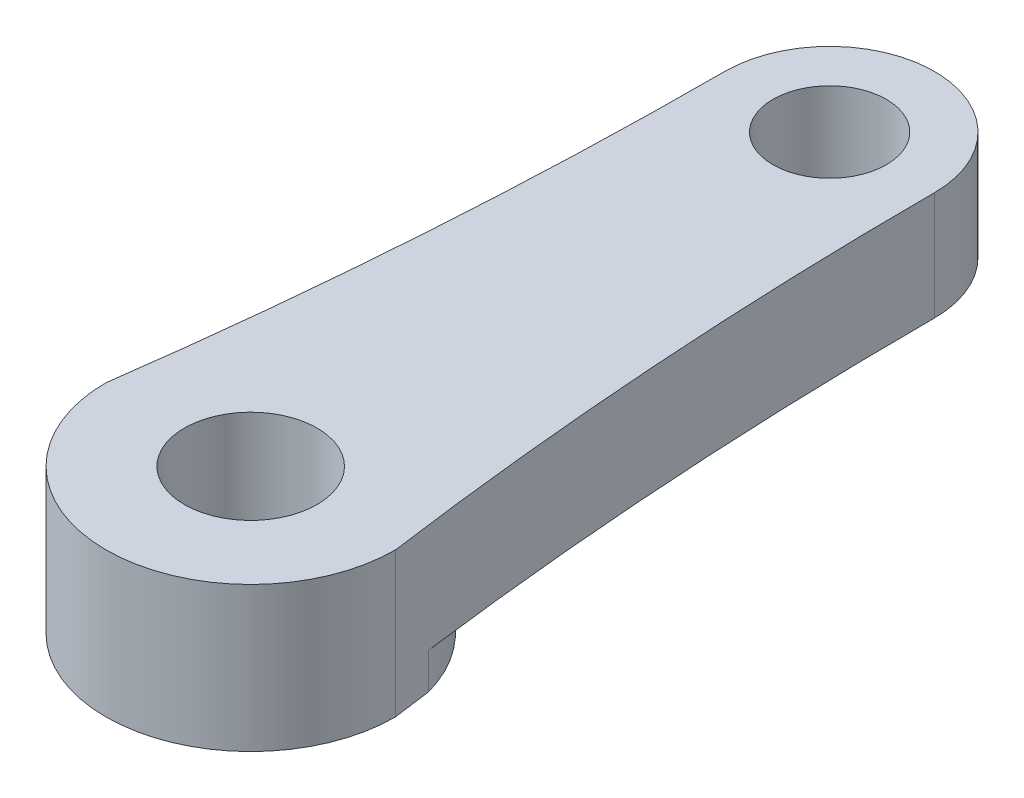
ISO-10303-21;
HEADER;
FILE_DESCRIPTION(('STEP AP214'),'2;1');
FILE_NAME('part.step','',(''),(''),'','','');
FILE_SCHEMA(('AUTOMOTIVE_DESIGN { 1 0 10303 214 1 1 1 1 }'));
ENDSEC;
DATA;
#1=APPLICATION_CONTEXT('core data for automotive mechanical design processes');
#2=APPLICATION_PROTOCOL_DEFINITION('international standard','automotive_design',2000,#1);
#3=PRODUCT_CONTEXT('',#1,'mechanical');
#4=PRODUCT('Part','Part','',(#3));
#5=PRODUCT_RELATED_PRODUCT_CATEGORY('part','',(#4));
#6=PRODUCT_DEFINITION_FORMATION('','',#4);
#7=PRODUCT_DEFINITION_CONTEXT('part definition',#1,'design');
#8=PRODUCT_DEFINITION('design','',#6,#7);
#9=PRODUCT_DEFINITION_SHAPE('','',#8);
#10=(LENGTH_UNIT() NAMED_UNIT(*) SI_UNIT(.MILLI.,.METRE.));
#11=(NAMED_UNIT(*) PLANE_ANGLE_UNIT() SI_UNIT($,.RADIAN.));
#12=(NAMED_UNIT(*) SI_UNIT($,.STERADIAN.) SOLID_ANGLE_UNIT());
#13=UNCERTAINTY_MEASURE_WITH_UNIT(LENGTH_MEASURE(1.E-05),#10,'distance_accuracy_value','');
#14=(GEOMETRIC_REPRESENTATION_CONTEXT(3) GLOBAL_UNCERTAINTY_ASSIGNED_CONTEXT((#13)) GLOBAL_UNIT_ASSIGNED_CONTEXT((#10,
#11,#12)) REPRESENTATION_CONTEXT('',''));
#15=CARTESIAN_POINT('',(0.,0.,0.));
#16=DIRECTION('',(0.,0.,1.));
#17=DIRECTION('',(1.,0.,0.));
#18=AXIS2_PLACEMENT_3D('',#15,#16,#17);
#19=CARTESIAN_POINT('',(179.720454545455,6.,-24.0000000000001));
#20=DIRECTION('',(0.,-1.,0.));
#21=DIRECTION('',(0.,0.,-1.));
#22=AXIS2_PLACEMENT_3D('',#19,#20,#21);
#23=CYLINDRICAL_SURFACE('',#22,175.370454545455);
#24=CARTESIAN_POINT('',(179.720454545455,0.,-24.0000000000001));
#25=DIRECTION('',(0.,1.,0.));
#26=DIRECTION('',(0.,0.,1.));
#27=AXIS2_PLACEMENT_3D('',#24,#25,#26);
#28=CIRCLE('',#27,175.370454545455);
#29=CARTESIAN_POINT('',(5.78975187479319,0.,-1.57441202622919));
#30=VERTEX_POINT('',#29);
#31=CARTESIAN_POINT('',(6.,0.,1.76833374332386E-13));
#32=VERTEX_POINT('',#31);
#33=EDGE_CURVE('E86',#30,#32,#28,.T.);
#34=ORIENTED_EDGE('',*,*,#33,.F.);
#35=DIRECTION('',(0.,-1.,0.));
#36=VECTOR('',#35,1.);
#37=CARTESIAN_POINT('',(5.78975187479319,1.5,-1.57441202622919));
#38=LINE('',#37,#36);
#39=CARTESIAN_POINT('',(5.78975187479319,1.5,-1.57441202622919));
#40=VERTEX_POINT('',#39);
#41=EDGE_CURVE('E62',#40,#30,#38,.T.);
#42=ORIENTED_EDGE('',*,*,#41,.F.);
#43=CARTESIAN_POINT('',(179.720454545455,1.5,-24.0000000000001));
#44=DIRECTION('',(0.,-1.,0.));
#45=DIRECTION('',(0.,0.,-1.));
#46=AXIS2_PLACEMENT_3D('',#43,#44,#45);
#47=CIRCLE('',#46,175.370454545455);
#48=CARTESIAN_POINT('',(4.35,1.5,-24.));
#49=VERTEX_POINT('',#48);
#50=EDGE_CURVE('E125',#49,#40,#47,.F.);
#51=ORIENTED_EDGE('',*,*,#50,.F.);
#52=DIRECTION('',(0.,-1.,0.));
#53=VECTOR('',#52,1.);
#54=CARTESIAN_POINT('',(4.35,6.,-24.));
#55=LINE('',#54,#53);
#56=CARTESIAN_POINT('',(4.35,6.,-24.));
#57=VERTEX_POINT('',#56);
#58=EDGE_CURVE('E11',#57,#49,#55,.T.);
#59=ORIENTED_EDGE('',*,*,#58,.F.);
#60=CARTESIAN_POINT('',(179.720454545455,6.,-24.0000000000001));
#61=DIRECTION('',(0.,1.,0.));
#62=DIRECTION('',(0.,0.,1.));
#63=AXIS2_PLACEMENT_3D('',#60,#61,#62);
#64=CIRCLE('',#63,175.370454545455);
#65=CARTESIAN_POINT('',(6.,6.,1.76833374332386E-13));
#66=VERTEX_POINT('',#65);
#67=EDGE_CURVE('E147',#57,#66,#64,.T.);
#68=ORIENTED_EDGE('',*,*,#67,.T.);
#69=DIRECTION('',(0.,-1.,0.));
#70=VECTOR('',#69,1.);
#71=CARTESIAN_POINT('',(6.,6.,1.76833374332386E-13));
#72=LINE('',#71,#70);
#73=EDGE_CURVE('E167',#66,#32,#72,.T.);
#74=ORIENTED_EDGE('',*,*,#73,.T.);
#75=EDGE_LOOP('',(#34,#42,#51,#59,#68,#74));
#76=FACE_BOUND('',#75,.T.);
#77=ADVANCED_FACE('F47',(#76),#23,.F.);
#78=CARTESIAN_POINT('',(0.,6.,-24.));
#79=DIRECTION('',(0.,-1.,0.));
#80=DIRECTION('',(0.,0.,-1.));
#81=AXIS2_PLACEMENT_3D('',#78,#79,#80);
#82=CYLINDRICAL_SURFACE('',#81,4.35);
#83=CARTESIAN_POINT('',(0.,1.5,-24.));
#84=DIRECTION('',(0.,-1.,0.));
#85=DIRECTION('',(0.,0.,-1.));
#86=AXIS2_PLACEMENT_3D('',#83,#84,#85);
#87=CIRCLE('',#86,4.35);
#88=CARTESIAN_POINT('',(-4.35,1.5,-24.));
#89=VERTEX_POINT('',#88);
#90=EDGE_CURVE('E133',#89,#49,#87,.T.);
#91=ORIENTED_EDGE('',*,*,#90,.F.);
#92=DIRECTION('',(0.,-1.,0.));
#93=VECTOR('',#92,1.);
#94=CARTESIAN_POINT('',(-4.35,6.,-24.));
#95=LINE('',#94,#93);
#96=CARTESIAN_POINT('',(-4.35,6.,-24.));
#97=VERTEX_POINT('',#96);
#98=EDGE_CURVE('E55',#97,#89,#95,.T.);
#99=ORIENTED_EDGE('',*,*,#98,.F.);
#100=CARTESIAN_POINT('',(0.,6.,-24.));
#101=DIRECTION('',(0.,1.,0.));
#102=DIRECTION('',(0.,0.,1.));
#103=AXIS2_PLACEMENT_3D('',#100,#101,#102);
#104=CIRCLE('',#103,4.35);
#105=EDGE_CURVE('E150',#57,#97,#104,.T.);
#106=ORIENTED_EDGE('',*,*,#105,.F.);
#107=ORIENTED_EDGE('',*,*,#58,.T.);
#108=EDGE_LOOP('',(#91,#99,#106,#107));
#109=FACE_BOUND('',#108,.T.);
#110=ADVANCED_FACE('F193',(#109),#82,.T.);
#111=CARTESIAN_POINT('',(-179.720454545455,6.,-24.0000000000001));
#112=DIRECTION('',(0.,-1.,0.));
#113=DIRECTION('',(0.,0.,-1.));
#114=AXIS2_PLACEMENT_3D('',#111,#112,#113);
#115=CYLINDRICAL_SURFACE('',#114,175.370454545455);
#116=DIRECTION('',(0.,-1.,0.));
#117=VECTOR('',#116,1.);
#118=CARTESIAN_POINT('',(-5.78975187479319,1.5,-1.57441202622919));
#119=LINE('',#118,#117);
#120=CARTESIAN_POINT('',(-5.78975187479319,1.5,-1.57441202622919));
#121=VERTEX_POINT('',#120);
#122=CARTESIAN_POINT('',(-5.78975187479319,0.,-1.57441202622919));
#123=VERTEX_POINT('',#122);
#124=EDGE_CURVE('E108',#121,#123,#119,.T.);
#125=ORIENTED_EDGE('',*,*,#124,.T.);
#126=CARTESIAN_POINT('',(-179.720454545455,0.,-24.0000000000001));
#127=DIRECTION('',(0.,1.,0.));
#128=DIRECTION('',(0.,0.,1.));
#129=AXIS2_PLACEMENT_3D('',#126,#127,#128);
#130=CIRCLE('',#129,175.370454545455);
#131=CARTESIAN_POINT('',(-6.,0.,1.76833374332386E-13));
#132=VERTEX_POINT('',#131);
#133=EDGE_CURVE('E170',#123,#132,#130,.F.);
#134=ORIENTED_EDGE('',*,*,#133,.T.);
#135=DIRECTION('',(0.,-1.,0.));
#136=VECTOR('',#135,1.);
#137=CARTESIAN_POINT('',(-6.,6.,1.76833374332386E-13));
#138=LINE('',#137,#136);
#139=CARTESIAN_POINT('',(-6.,6.,1.76833374332386E-13));
#140=VERTEX_POINT('',#139);
#141=EDGE_CURVE('E182',#140,#132,#138,.T.);
#142=ORIENTED_EDGE('',*,*,#141,.F.);
#143=CARTESIAN_POINT('',(-179.720454545455,6.,-24.0000000000001));
#144=DIRECTION('',(0.,1.,0.));
#145=DIRECTION('',(0.,0.,1.));
#146=AXIS2_PLACEMENT_3D('',#143,#144,#145);
#147=CIRCLE('',#146,175.370454545455);
#148=EDGE_CURVE('E154',#97,#140,#147,.F.);
#149=ORIENTED_EDGE('',*,*,#148,.F.);
#150=ORIENTED_EDGE('',*,*,#98,.T.);
#151=CARTESIAN_POINT('',(-179.720454545455,1.5,-24.0000000000001));
#152=DIRECTION('',(0.,-1.,0.));
#153=DIRECTION('',(0.,0.,-1.));
#154=AXIS2_PLACEMENT_3D('',#151,#152,#153);
#155=CIRCLE('',#154,175.370454545455);
#156=EDGE_CURVE('E123',#121,#89,#155,.F.);
#157=ORIENTED_EDGE('',*,*,#156,.F.);
#158=EDGE_LOOP('',(#125,#134,#142,#149,#150,#157));
#159=FACE_BOUND('',#158,.T.);
#160=ADVANCED_FACE('F129',(#159),#115,.F.);
#161=CARTESIAN_POINT('',(0.,6.,-24.));
#162=DIRECTION('',(0.,-1.,0.));
#163=DIRECTION('',(0.,0.,-1.));
#164=AXIS2_PLACEMENT_3D('',#161,#162,#163);
#165=CYLINDRICAL_SURFACE('',#164,2.35);
#166=CARTESIAN_POINT('',(0.,6.,-24.));
#167=DIRECTION('',(0.,1.,0.));
#168=DIRECTION('',(0.,0.,1.));
#169=AXIS2_PLACEMENT_3D('',#166,#167,#168);
#170=CIRCLE('',#169,2.35);
#171=CARTESIAN_POINT('',(0.,6.,-21.65));
#172=VERTEX_POINT('',#171);
#173=EDGE_CURVE('E159',#172,#172,#170,.T.);
#174=ORIENTED_EDGE('',*,*,#173,.T.);
#175=EDGE_LOOP('',(#174));
#176=FACE_BOUND('',#175,.T.);
#177=CARTESIAN_POINT('',(0.,1.5,-24.));
#178=DIRECTION('',(0.,-1.,0.));
#179=DIRECTION('',(0.,0.,-1.));
#180=AXIS2_PLACEMENT_3D('',#177,#178,#179);
#181=CIRCLE('',#180,2.35);
#182=CARTESIAN_POINT('',(0.,1.5,-26.35));
#183=VERTEX_POINT('',#182);
#184=EDGE_CURVE('E118',#183,#183,#181,.F.);
#185=ORIENTED_EDGE('',*,*,#184,.F.);
#186=EDGE_LOOP('',(#185));
#187=FACE_BOUND('',#186,.T.);
#188=ADVANCED_FACE('F199',(#176,#187),#165,.F.);
#189=CARTESIAN_POINT('',(0.,0.,0.));
#190=DIRECTION('',(0.,1.,0.));
#191=DIRECTION('',(0.,0.,1.));
#192=AXIS2_PLACEMENT_3D('',#189,#190,#191);
#193=PLANE('',#192);
#194=CARTESIAN_POINT('',(0.,0.,0.));
#195=DIRECTION('',(0.,1.,0.));
#196=DIRECTION('',(0.,0.,1.));
#197=AXIS2_PLACEMENT_3D('',#194,#195,#196);
#198=CIRCLE('',#197,2.75);
#199=CARTESIAN_POINT('',(0.,0.,2.75));
#200=VERTEX_POINT('',#199);
#201=EDGE_CURVE('E151',#200,#200,#198,.T.);
#202=ORIENTED_EDGE('',*,*,#201,.T.);
#203=EDGE_LOOP('',(#202));
#204=FACE_BOUND('',#203,.T.);
#205=CARTESIAN_POINT('',(0.,0.,0.));
#206=DIRECTION('',(0.,-1.,0.));
#207=DIRECTION('',(0.,0.,-1.));
#208=AXIS2_PLACEMENT_3D('',#205,#206,#207);
#209=CIRCLE('',#208,6.);
#210=EDGE_CURVE('E113',#123,#30,#209,.T.);
#211=ORIENTED_EDGE('',*,*,#210,.T.);
#212=ORIENTED_EDGE('',*,*,#33,.T.);
#213=CARTESIAN_POINT('',(0.,0.,0.));
#214=DIRECTION('',(0.,1.,0.));
#215=DIRECTION('',(0.,0.,1.));
#216=AXIS2_PLACEMENT_3D('',#213,#214,#215);
#217=CIRCLE('',#216,6.);
#218=EDGE_CURVE('E173',#132,#32,#217,.T.);
#219=ORIENTED_EDGE('',*,*,#218,.F.);
#220=ORIENTED_EDGE('',*,*,#133,.F.);
#221=EDGE_LOOP('',(#211,#212,#219,#220));
#222=FACE_BOUND('',#221,.T.);
#223=ADVANCED_FACE('F189',(#204,#222),#193,.F.);
#224=CARTESIAN_POINT('',(0.,6.,0.));
#225=DIRECTION('',(0.,-1.,0.));
#226=DIRECTION('',(0.,0.,-1.));
#227=AXIS2_PLACEMENT_3D('',#224,#225,#226);
#228=CYLINDRICAL_SURFACE('',#227,6.);
#229=ORIENTED_EDGE('',*,*,#218,.T.);
#230=ORIENTED_EDGE('',*,*,#73,.F.);
#231=CARTESIAN_POINT('',(0.,6.,0.));
#232=DIRECTION('',(0.,1.,0.));
#233=DIRECTION('',(0.,0.,1.));
#234=AXIS2_PLACEMENT_3D('',#231,#232,#233);
#235=CIRCLE('',#234,6.);
#236=EDGE_CURVE('E71',#140,#66,#235,.T.);
#237=ORIENTED_EDGE('',*,*,#236,.F.);
#238=ORIENTED_EDGE('',*,*,#141,.T.);
#239=EDGE_LOOP('',(#229,#230,#237,#238));
#240=FACE_BOUND('',#239,.T.);
#241=ADVANCED_FACE('F188',(#240),#228,.T.);
#242=CARTESIAN_POINT('',(0.,6.,0.));
#243=DIRECTION('',(0.,-1.,0.));
#244=DIRECTION('',(0.,0.,-1.));
#245=AXIS2_PLACEMENT_3D('',#242,#243,#244);
#246=CYLINDRICAL_SURFACE('',#245,2.75);
#247=CARTESIAN_POINT('',(0.,6.,0.));
#248=DIRECTION('',(0.,1.,0.));
#249=DIRECTION('',(0.,0.,1.));
#250=AXIS2_PLACEMENT_3D('',#247,#248,#249);
#251=CIRCLE('',#250,2.75);
#252=CARTESIAN_POINT('',(0.,6.,2.75));
#253=VERTEX_POINT('',#252);
#254=EDGE_CURVE('E163',#253,#253,#251,.T.);
#255=ORIENTED_EDGE('',*,*,#254,.T.);
#256=EDGE_LOOP('',(#255));
#257=FACE_BOUND('',#256,.T.);
#258=ORIENTED_EDGE('',*,*,#201,.F.);
#259=EDGE_LOOP('',(#258));
#260=FACE_BOUND('',#259,.T.);
#261=ADVANCED_FACE('F204',(#257,#260),#246,.F.);
#262=CARTESIAN_POINT('',(0.,6.,0.));
#263=DIRECTION('',(0.,1.,0.));
#264=DIRECTION('',(0.,0.,1.));
#265=AXIS2_PLACEMENT_3D('',#262,#263,#264);
#266=PLANE('',#265);
#267=ORIENTED_EDGE('',*,*,#67,.F.);
#268=ORIENTED_EDGE('',*,*,#105,.T.);
#269=ORIENTED_EDGE('',*,*,#148,.T.);
#270=ORIENTED_EDGE('',*,*,#236,.T.);
#271=EDGE_LOOP('',(#267,#268,#269,#270));
#272=FACE_BOUND('',#271,.T.);
#273=ORIENTED_EDGE('',*,*,#173,.F.);
#274=EDGE_LOOP('',(#273));
#275=FACE_BOUND('',#274,.T.);
#276=ORIENTED_EDGE('',*,*,#254,.F.);
#277=EDGE_LOOP('',(#276));
#278=FACE_BOUND('',#277,.T.);
#279=ADVANCED_FACE('F190',(#272,#275,#278),#266,.T.);
#280=CARTESIAN_POINT('',(0.,1.5,0.));
#281=DIRECTION('',(0.,-1.,0.));
#282=DIRECTION('',(0.,0.,-1.));
#283=AXIS2_PLACEMENT_3D('',#280,#281,#282);
#284=CYLINDRICAL_SURFACE('',#283,6.);
#285=ORIENTED_EDGE('',*,*,#210,.F.);
#286=ORIENTED_EDGE('',*,*,#124,.F.);
#287=CARTESIAN_POINT('',(0.,1.5,0.));
#288=DIRECTION('',(0.,-1.,0.));
#289=DIRECTION('',(0.,0.,-1.));
#290=AXIS2_PLACEMENT_3D('',#287,#288,#289);
#291=CIRCLE('',#290,6.);
#292=EDGE_CURVE('E111',#121,#40,#291,.T.);
#293=ORIENTED_EDGE('',*,*,#292,.T.);
#294=ORIENTED_EDGE('',*,*,#41,.T.);
#295=EDGE_LOOP('',(#285,#286,#293,#294));
#296=FACE_BOUND('',#295,.T.);
#297=ADVANCED_FACE('F110',(#296),#284,.T.);
#298=CARTESIAN_POINT('',(0.,1.5,0.));
#299=DIRECTION('',(0.,-1.,0.));
#300=DIRECTION('',(0.,0.,-1.));
#301=AXIS2_PLACEMENT_3D('',#298,#299,#300);
#302=PLANE('',#301);
#303=ORIENTED_EDGE('',*,*,#292,.F.);
#304=ORIENTED_EDGE('',*,*,#156,.T.);
#305=ORIENTED_EDGE('',*,*,#90,.T.);
#306=ORIENTED_EDGE('',*,*,#50,.T.);
#307=EDGE_LOOP('',(#303,#304,#305,#306));
#308=FACE_BOUND('',#307,.T.);
#309=ORIENTED_EDGE('',*,*,#184,.T.);
#310=EDGE_LOOP('',(#309));
#311=FACE_BOUND('',#310,.T.);
#312=ADVANCED_FACE('F121',(#308,#311),#302,.T.);
#313=CLOSED_SHELL('',(#77,#110,#160,#188,#223,#241,#261,#279,#297,#312));
#314=MANIFOLD_SOLID_BREP('B2',#313);
#315=ADVANCED_BREP_SHAPE_REPRESENTATION('',(#18,#314),#14);
#316=SHAPE_DEFINITION_REPRESENTATION(#9,#315);
ENDSEC;
END-ISO-10303-21;
